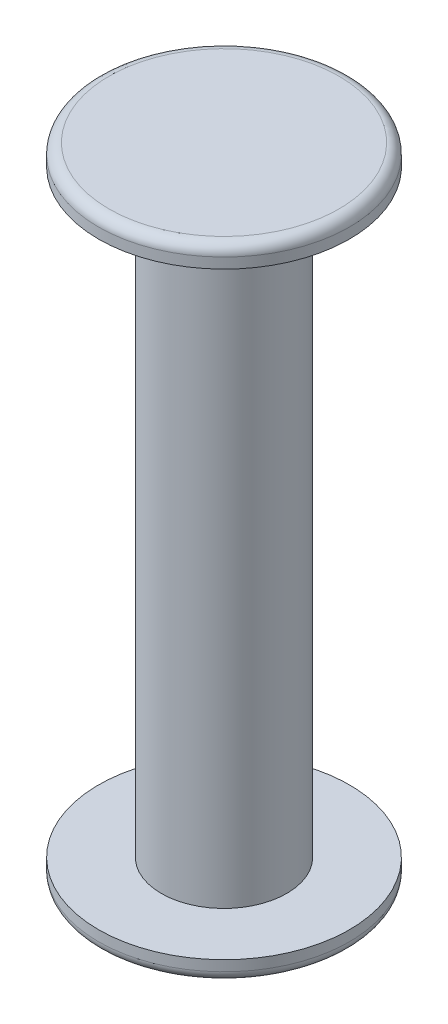
ISO-10303-21;
HEADER;
FILE_DESCRIPTION(('STEP AP214'),'2;1');
FILE_NAME('part.step','',(''),(''),'','','');
FILE_SCHEMA(('AUTOMOTIVE_DESIGN { 1 0 10303 214 1 1 1 1 }'));
ENDSEC;
DATA;
#1=APPLICATION_CONTEXT('core data for automotive mechanical design processes');
#2=APPLICATION_PROTOCOL_DEFINITION('international standard','automotive_design',2000,#1);
#3=PRODUCT_CONTEXT('',#1,'mechanical');
#4=PRODUCT('Part','Part','',(#3));
#5=PRODUCT_RELATED_PRODUCT_CATEGORY('part','',(#4));
#6=PRODUCT_DEFINITION_FORMATION('','',#4);
#7=PRODUCT_DEFINITION_CONTEXT('part definition',#1,'design');
#8=PRODUCT_DEFINITION('design','',#6,#7);
#9=PRODUCT_DEFINITION_SHAPE('','',#8);
#10=(LENGTH_UNIT() NAMED_UNIT(*) SI_UNIT(.MILLI.,.METRE.));
#11=(NAMED_UNIT(*) PLANE_ANGLE_UNIT() SI_UNIT($,.RADIAN.));
#12=(NAMED_UNIT(*) SI_UNIT($,.STERADIAN.) SOLID_ANGLE_UNIT());
#13=UNCERTAINTY_MEASURE_WITH_UNIT(LENGTH_MEASURE(1.E-05),#10,'distance_accuracy_value','');
#14=(GEOMETRIC_REPRESENTATION_CONTEXT(3) GLOBAL_UNCERTAINTY_ASSIGNED_CONTEXT((#13)) GLOBAL_UNIT_ASSIGNED_CONTEXT((#10,
#11,#12)) REPRESENTATION_CONTEXT('',''));
#15=CARTESIAN_POINT('',(0.,0.,0.));
#16=DIRECTION('',(0.,0.,1.));
#17=DIRECTION('',(1.,0.,0.));
#18=AXIS2_PLACEMENT_3D('',#15,#16,#17);
#19=CARTESIAN_POINT('',(0.,14.3,0.));
#20=DIRECTION('',(0.,-1.,0.));
#21=DIRECTION('',(0.,0.,-1.));
#22=AXIS2_PLACEMENT_3D('',#19,#20,#21);
#23=CYLINDRICAL_SURFACE('',#22,3.);
#24=CARTESIAN_POINT('',(0.,14.3,0.));
#25=DIRECTION('',(0.,1.,0.));
#26=DIRECTION('',(0.,0.,1.));
#27=AXIS2_PLACEMENT_3D('',#24,#25,#26);
#28=CIRCLE('',#27,3.);
#29=CARTESIAN_POINT('',(0.,14.3,3.));
#30=VERTEX_POINT('',#29);
#31=EDGE_CURVE('E53',#30,#30,#28,.T.);
#32=ORIENTED_EDGE('',*,*,#31,.F.);
#33=EDGE_LOOP('',(#32));
#34=FACE_BOUND('',#33,.T.);
#35=CARTESIAN_POINT('',(0.,-14.3,0.));
#36=DIRECTION('',(0.,1.,0.));
#37=DIRECTION('',(0.,0.,1.));
#38=AXIS2_PLACEMENT_3D('',#35,#36,#37);
#39=CIRCLE('',#38,3.);
#40=CARTESIAN_POINT('',(0.,-14.3,3.));
#41=VERTEX_POINT('',#40);
#42=EDGE_CURVE('E54',#41,#41,#39,.T.);
#43=ORIENTED_EDGE('',*,*,#42,.T.);
#44=EDGE_LOOP('',(#43));
#45=FACE_BOUND('',#44,.T.);
#46=ADVANCED_FACE('F33',(#34,#45),#23,.T.);
#47=CARTESIAN_POINT('',(0.,15.3,0.));
#48=DIRECTION('',(0.,-1.,0.));
#49=DIRECTION('',(0.,0.,-1.));
#50=AXIS2_PLACEMENT_3D('',#47,#48,#49);
#51=CYLINDRICAL_SURFACE('',#50,6.);
#52=CARTESIAN_POINT('',(0.,14.8,0.));
#53=DIRECTION('',(0.,1.,0.));
#54=DIRECTION('',(0.,0.,1.));
#55=AXIS2_PLACEMENT_3D('',#52,#53,#54);
#56=CIRCLE('',#55,6.);
#57=CARTESIAN_POINT('',(0.,14.8,6.));
#58=VERTEX_POINT('',#57);
#59=EDGE_CURVE('E44',#58,#58,#56,.F.);
#60=ORIENTED_EDGE('',*,*,#59,.T.);
#61=EDGE_LOOP('',(#60));
#62=FACE_BOUND('',#61,.T.);
#63=CARTESIAN_POINT('',(0.,14.3,0.));
#64=DIRECTION('',(0.,1.,0.));
#65=DIRECTION('',(0.,0.,1.));
#66=AXIS2_PLACEMENT_3D('',#63,#64,#65);
#67=CIRCLE('',#66,6.);
#68=CARTESIAN_POINT('',(0.,14.3,6.));
#69=VERTEX_POINT('',#68);
#70=EDGE_CURVE('E57',#69,#69,#67,.T.);
#71=ORIENTED_EDGE('',*,*,#70,.T.);
#72=EDGE_LOOP('',(#71));
#73=FACE_BOUND('',#72,.T.);
#74=ADVANCED_FACE('F83',(#62,#73),#51,.T.);
#75=CARTESIAN_POINT('',(0.,15.3,0.));
#76=DIRECTION('',(0.,1.,0.));
#77=DIRECTION('',(0.,0.,1.));
#78=AXIS2_PLACEMENT_3D('',#75,#76,#77);
#79=PLANE('',#78);
#80=CARTESIAN_POINT('',(0.,15.3,0.));
#81=DIRECTION('',(0.,1.,0.));
#82=DIRECTION('',(0.,0.,1.));
#83=AXIS2_PLACEMENT_3D('',#80,#81,#82);
#84=CIRCLE('',#83,5.5);
#85=CARTESIAN_POINT('',(0.,15.3,5.5));
#86=VERTEX_POINT('',#85);
#87=EDGE_CURVE('E48',#86,#86,#84,.T.);
#88=ORIENTED_EDGE('',*,*,#87,.T.);
#89=EDGE_LOOP('',(#88));
#90=FACE_BOUND('',#89,.T.);
#91=ADVANCED_FACE('F89',(#90),#79,.T.);
#92=CARTESIAN_POINT('',(0.,14.3,0.));
#93=DIRECTION('',(0.,1.,0.));
#94=DIRECTION('',(0.,0.,1.));
#95=AXIS2_PLACEMENT_3D('',#92,#93,#94);
#96=PLANE('',#95);
#97=ORIENTED_EDGE('',*,*,#31,.T.);
#98=EDGE_LOOP('',(#97));
#99=FACE_BOUND('',#98,.T.);
#100=ORIENTED_EDGE('',*,*,#70,.F.);
#101=EDGE_LOOP('',(#100));
#102=FACE_BOUND('',#101,.T.);
#103=ADVANCED_FACE('F78',(#99,#102),#96,.F.);
#104=CARTESIAN_POINT('',(0.,14.8,0.));
#105=DIRECTION('',(0.,1.,0.));
#106=DIRECTION('',(0.,0.,1.));
#107=AXIS2_PLACEMENT_3D('',#104,#105,#106);
#108=TOROIDAL_SURFACE('',#107,5.5,0.5);
#109=ORIENTED_EDGE('',*,*,#59,.F.);
#110=EDGE_LOOP('',(#109));
#111=FACE_BOUND('',#110,.T.);
#112=ORIENTED_EDGE('',*,*,#87,.F.);
#113=EDGE_LOOP('',(#112));
#114=FACE_BOUND('',#113,.T.);
#115=ADVANCED_FACE('F71',(#111,#114),#108,.T.);
#116=CARTESIAN_POINT('',(0.,-15.3,0.));
#117=DIRECTION('',(0.,1.,0.));
#118=DIRECTION('',(0.,0.,1.));
#119=AXIS2_PLACEMENT_3D('',#116,#117,#118);
#120=CYLINDRICAL_SURFACE('',#119,6.);
#121=CARTESIAN_POINT('',(0.,-14.8,0.));
#122=DIRECTION('',(0.,-1.,0.));
#123=DIRECTION('',(0.,0.,-1.));
#124=AXIS2_PLACEMENT_3D('',#121,#122,#123);
#125=CIRCLE('',#124,6.);
#126=CARTESIAN_POINT('',(0.,-14.8,-6.));
#127=VERTEX_POINT('',#126);
#128=EDGE_CURVE('E40',#127,#127,#125,.F.);
#129=ORIENTED_EDGE('',*,*,#128,.T.);
#130=EDGE_LOOP('',(#129));
#131=FACE_BOUND('',#130,.T.);
#132=CARTESIAN_POINT('',(0.,-14.3,0.));
#133=DIRECTION('',(0.,1.,0.));
#134=DIRECTION('',(0.,0.,1.));
#135=AXIS2_PLACEMENT_3D('',#132,#133,#134);
#136=CIRCLE('',#135,6.);
#137=CARTESIAN_POINT('',(0.,-14.3,6.));
#138=VERTEX_POINT('',#137);
#139=EDGE_CURVE('E58',#138,#138,#136,.T.);
#140=ORIENTED_EDGE('',*,*,#139,.F.);
#141=EDGE_LOOP('',(#140));
#142=FACE_BOUND('',#141,.T.);
#143=ADVANCED_FACE('F68',(#131,#142),#120,.T.);
#144=CARTESIAN_POINT('',(0.,-15.3,0.));
#145=DIRECTION('',(0.,-1.,0.));
#146=DIRECTION('',(0.,0.,1.));
#147=AXIS2_PLACEMENT_3D('',#144,#145,#146);
#148=PLANE('',#147);
#149=CARTESIAN_POINT('',(0.,-15.3,0.));
#150=DIRECTION('',(0.,-1.,0.));
#151=DIRECTION('',(0.,0.,-1.));
#152=AXIS2_PLACEMENT_3D('',#149,#150,#151);
#153=CIRCLE('',#152,5.5);
#154=CARTESIAN_POINT('',(0.,-15.3,-5.5));
#155=VERTEX_POINT('',#154);
#156=EDGE_CURVE('E10',#155,#155,#153,.T.);
#157=ORIENTED_EDGE('',*,*,#156,.T.);
#158=EDGE_LOOP('',(#157));
#159=FACE_BOUND('',#158,.T.);
#160=ADVANCED_FACE('F70',(#159),#148,.T.);
#161=CARTESIAN_POINT('',(0.,-14.3,0.));
#162=DIRECTION('',(0.,-1.,0.));
#163=DIRECTION('',(0.,0.,1.));
#164=AXIS2_PLACEMENT_3D('',#161,#162,#163);
#165=PLANE('',#164);
#166=ORIENTED_EDGE('',*,*,#42,.F.);
#167=EDGE_LOOP('',(#166));
#168=FACE_BOUND('',#167,.T.);
#169=ORIENTED_EDGE('',*,*,#139,.T.);
#170=EDGE_LOOP('',(#169));
#171=FACE_BOUND('',#170,.T.);
#172=ADVANCED_FACE('F66',(#168,#171),#165,.F.);
#173=CARTESIAN_POINT('',(0.,-14.8,0.));
#174=DIRECTION('',(0.,-1.,0.));
#175=DIRECTION('',(0.,0.,-1.));
#176=AXIS2_PLACEMENT_3D('',#173,#174,#175);
#177=TOROIDAL_SURFACE('',#176,5.5,0.5);
#178=ORIENTED_EDGE('',*,*,#156,.F.);
#179=EDGE_LOOP('',(#178));
#180=FACE_BOUND('',#179,.T.);
#181=ORIENTED_EDGE('',*,*,#128,.F.);
#182=EDGE_LOOP('',(#181));
#183=FACE_BOUND('',#182,.T.);
#184=ADVANCED_FACE('F35',(#180,#183),#177,.T.);
#185=CLOSED_SHELL('',(#46,#74,#91,#103,#115,#143,#160,#172,#184));
#186=MANIFOLD_SOLID_BREP('B2',#185);
#187=ADVANCED_BREP_SHAPE_REPRESENTATION('',(#18,#186),#14);
#188=SHAPE_DEFINITION_REPRESENTATION(#9,#187);
ENDSEC;
END-ISO-10303-21;
